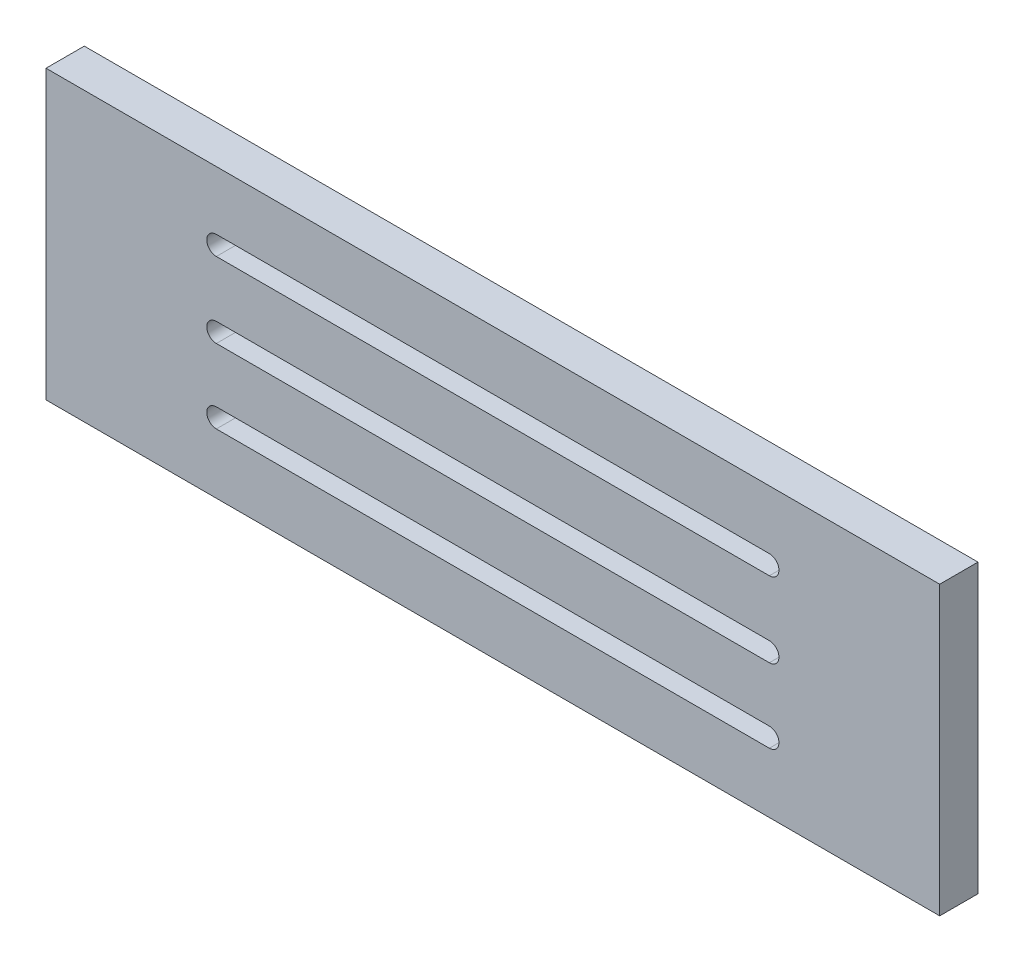
ISO-10303-21;
HEADER;
FILE_DESCRIPTION(('STEP AP214'),'2;1');
FILE_NAME('part.step','',(''),(''),'','','');
FILE_SCHEMA(('AUTOMOTIVE_DESIGN { 1 0 10303 214 1 1 1 1 }'));
ENDSEC;
DATA;
#1=APPLICATION_CONTEXT('core data for automotive mechanical design processes');
#2=APPLICATION_PROTOCOL_DEFINITION('international standard','automotive_design',2000,#1);
#3=PRODUCT_CONTEXT('',#1,'mechanical');
#4=PRODUCT('Part','Part','',(#3));
#5=PRODUCT_RELATED_PRODUCT_CATEGORY('part','',(#4));
#6=PRODUCT_DEFINITION_FORMATION('','',#4);
#7=PRODUCT_DEFINITION_CONTEXT('part definition',#1,'design');
#8=PRODUCT_DEFINITION('design','',#6,#7);
#9=PRODUCT_DEFINITION_SHAPE('','',#8);
#10=(LENGTH_UNIT() NAMED_UNIT(*) SI_UNIT(.MILLI.,.METRE.));
#11=(NAMED_UNIT(*) PLANE_ANGLE_UNIT() SI_UNIT($,.RADIAN.));
#12=(NAMED_UNIT(*) SI_UNIT($,.STERADIAN.) SOLID_ANGLE_UNIT());
#13=UNCERTAINTY_MEASURE_WITH_UNIT(LENGTH_MEASURE(1.E-05),#10,'distance_accuracy_value','');
#14=(GEOMETRIC_REPRESENTATION_CONTEXT(3) GLOBAL_UNCERTAINTY_ASSIGNED_CONTEXT((#13)) GLOBAL_UNIT_ASSIGNED_CONTEXT((#10,
#11,#12)) REPRESENTATION_CONTEXT('',''));
#15=CARTESIAN_POINT('',(0.,0.,0.));
#16=DIRECTION('',(0.,0.,1.));
#17=DIRECTION('',(1.,0.,0.));
#18=AXIS2_PLACEMENT_3D('',#15,#16,#17);
#19=CARTESIAN_POINT('',(0.,0.,6.));
#20=DIRECTION('',(0.,0.,-1.));
#21=DIRECTION('',(-1.,0.,0.));
#22=AXIS2_PLACEMENT_3D('',#19,#20,#21);
#23=PLANE('',#22);
#24=CARTESIAN_POINT('',(26.6832032308396,34.3036981476396,6.));
#25=DIRECTION('',(0.,0.,1.));
#26=DIRECTION('',(1.,0.,0.));
#27=AXIS2_PLACEMENT_3D('',#24,#25,#26);
#28=CIRCLE('',#27,1.5);
#29=CARTESIAN_POINT('',(26.6832032308396,35.8036981476396,6.));
#30=VERTEX_POINT('',#29);
#31=CARTESIAN_POINT('',(26.6832032308396,32.8036981476396,6.));
#32=VERTEX_POINT('',#31);
#33=EDGE_CURVE('E185',#30,#32,#28,.T.);
#34=ORIENTED_EDGE('',*,*,#33,.F.);
#35=DIRECTION('',(-1.,0.,0.));
#36=VECTOR('',#35,1.);
#37=CARTESIAN_POINT('',(26.6832032308396,35.8036981476396,6.));
#38=LINE('',#37,#36);
#39=CARTESIAN_POINT('',(113.31679676916,35.8036981476396,6.));
#40=VERTEX_POINT('',#39);
#41=EDGE_CURVE('E193',#40,#30,#38,.T.);
#42=ORIENTED_EDGE('',*,*,#41,.F.);
#43=CARTESIAN_POINT('',(113.31679676916,34.3036981476396,6.));
#44=DIRECTION('',(0.,0.,1.));
#45=DIRECTION('',(1.,0.,0.));
#46=AXIS2_PLACEMENT_3D('',#43,#44,#45);
#47=CIRCLE('',#46,1.5);
#48=CARTESIAN_POINT('',(113.31679676916,32.8036981476396,6.));
#49=VERTEX_POINT('',#48);
#50=EDGE_CURVE('E190',#49,#40,#47,.T.);
#51=ORIENTED_EDGE('',*,*,#50,.F.);
#52=DIRECTION('',(1.,0.,0.));
#53=VECTOR('',#52,1.);
#54=CARTESIAN_POINT('',(26.6832032308396,32.8036981476396,6.));
#55=LINE('',#54,#53);
#56=EDGE_CURVE('E187',#32,#49,#55,.T.);
#57=ORIENTED_EDGE('',*,*,#56,.F.);
#58=EDGE_LOOP('',(#34,#42,#51,#57));
#59=FACE_BOUND('',#58,.T.);
#60=DIRECTION('',(0.,-1.,0.));
#61=VECTOR('',#60,1.);
#62=CARTESIAN_POINT('',(0.,0.,6.));
#63=LINE('',#62,#61);
#64=CARTESIAN_POINT('',(0.,45.,6.));
#65=VERTEX_POINT('',#64);
#66=CARTESIAN_POINT('',(0.,0.,6.));
#67=VERTEX_POINT('',#66);
#68=EDGE_CURVE('E247',#65,#67,#63,.T.);
#69=ORIENTED_EDGE('',*,*,#68,.T.);
#70=DIRECTION('',(1.,0.,0.));
#71=VECTOR('',#70,1.);
#72=CARTESIAN_POINT('',(0.,0.,6.));
#73=LINE('',#72,#71);
#74=CARTESIAN_POINT('',(140.,0.,6.));
#75=VERTEX_POINT('',#74);
#76=EDGE_CURVE('E250',#67,#75,#73,.T.);
#77=ORIENTED_EDGE('',*,*,#76,.T.);
#78=DIRECTION('',(0.,1.,0.));
#79=VECTOR('',#78,1.);
#80=CARTESIAN_POINT('',(140.,0.,6.));
#81=LINE('',#80,#79);
#82=CARTESIAN_POINT('',(140.,45.,6.));
#83=VERTEX_POINT('',#82);
#84=EDGE_CURVE('E253',#75,#83,#81,.T.);
#85=ORIENTED_EDGE('',*,*,#84,.T.);
#86=DIRECTION('',(-1.,0.,0.));
#87=VECTOR('',#86,1.);
#88=CARTESIAN_POINT('',(0.,45.,6.));
#89=LINE('',#88,#87);
#90=EDGE_CURVE('E255',#83,#65,#89,.T.);
#91=ORIENTED_EDGE('',*,*,#90,.T.);
#92=EDGE_LOOP('',(#69,#77,#85,#91));
#93=FACE_BOUND('',#92,.T.);
#94=CARTESIAN_POINT('',(26.6832032308396,22.5,6.));
#95=DIRECTION('',(0.,0.,1.));
#96=DIRECTION('',(1.,0.,0.));
#97=AXIS2_PLACEMENT_3D('',#94,#95,#96);
#98=CIRCLE('',#97,1.5);
#99=CARTESIAN_POINT('',(26.6832032308396,24.,6.));
#100=VERTEX_POINT('',#99);
#101=CARTESIAN_POINT('',(26.6832032308396,21.,6.));
#102=VERTEX_POINT('',#101);
#103=EDGE_CURVE('E216',#100,#102,#98,.T.);
#104=ORIENTED_EDGE('',*,*,#103,.F.);
#105=DIRECTION('',(-1.,0.,0.));
#106=VECTOR('',#105,1.);
#107=CARTESIAN_POINT('',(26.6832032308396,24.,6.));
#108=LINE('',#107,#106);
#109=CARTESIAN_POINT('',(113.31679676916,24.,6.));
#110=VERTEX_POINT('',#109);
#111=EDGE_CURVE('E224',#110,#100,#108,.T.);
#112=ORIENTED_EDGE('',*,*,#111,.F.);
#113=CARTESIAN_POINT('',(113.31679676916,22.5,6.));
#114=DIRECTION('',(0.,0.,1.));
#115=DIRECTION('',(1.,0.,0.));
#116=AXIS2_PLACEMENT_3D('',#113,#114,#115);
#117=CIRCLE('',#116,1.5);
#118=CARTESIAN_POINT('',(113.31679676916,21.,6.));
#119=VERTEX_POINT('',#118);
#120=EDGE_CURVE('E221',#119,#110,#117,.T.);
#121=ORIENTED_EDGE('',*,*,#120,.F.);
#122=DIRECTION('',(1.,0.,0.));
#123=VECTOR('',#122,1.);
#124=CARTESIAN_POINT('',(26.6832032308396,21.,6.));
#125=LINE('',#124,#123);
#126=EDGE_CURVE('E218',#102,#119,#125,.T.);
#127=ORIENTED_EDGE('',*,*,#126,.F.);
#128=EDGE_LOOP('',(#104,#112,#121,#127));
#129=FACE_BOUND('',#128,.T.);
#130=CARTESIAN_POINT('',(26.6832032308396,10.9053187025472,6.));
#131=DIRECTION('',(0.,0.,1.));
#132=DIRECTION('',(1.,0.,0.));
#133=AXIS2_PLACEMENT_3D('',#130,#131,#132);
#134=CIRCLE('',#133,1.5);
#135=CARTESIAN_POINT('',(26.6832032308396,12.4053187025472,6.));
#136=VERTEX_POINT('',#135);
#137=CARTESIAN_POINT('',(26.6832032308396,9.40531870254718,6.));
#138=VERTEX_POINT('',#137);
#139=EDGE_CURVE('E149',#136,#138,#134,.T.);
#140=ORIENTED_EDGE('',*,*,#139,.F.);
#141=DIRECTION('',(-1.,0.,0.));
#142=VECTOR('',#141,1.);
#143=CARTESIAN_POINT('',(26.6832032308396,12.4053187025472,6.));
#144=LINE('',#143,#142);
#145=CARTESIAN_POINT('',(113.31679676916,12.4053187025472,6.));
#146=VERTEX_POINT('',#145);
#147=EDGE_CURVE('E171',#146,#136,#144,.T.);
#148=ORIENTED_EDGE('',*,*,#147,.F.);
#149=CARTESIAN_POINT('',(113.31679676916,10.9053187025472,6.));
#150=DIRECTION('',(0.,0.,1.));
#151=DIRECTION('',(1.,0.,0.));
#152=AXIS2_PLACEMENT_3D('',#149,#150,#151);
#153=CIRCLE('',#152,1.5);
#154=CARTESIAN_POINT('',(113.31679676916,9.40531870254718,6.));
#155=VERTEX_POINT('',#154);
#156=EDGE_CURVE('E169',#155,#146,#153,.T.);
#157=ORIENTED_EDGE('',*,*,#156,.F.);
#158=DIRECTION('',(1.,0.,0.));
#159=VECTOR('',#158,1.);
#160=CARTESIAN_POINT('',(26.6832032308396,9.40531870254718,6.));
#161=LINE('',#160,#159);
#162=EDGE_CURVE('E157',#138,#155,#161,.T.);
#163=ORIENTED_EDGE('',*,*,#162,.F.);
#164=EDGE_LOOP('',(#140,#148,#157,#163));
#165=FACE_BOUND('',#164,.T.);
#166=ADVANCED_FACE('F36',(#59,#93,#129,#165),#23,.F.);
#167=CARTESIAN_POINT('',(0.,0.,0.));
#168=DIRECTION('',(0.,0.,-1.));
#169=DIRECTION('',(-1.,0.,0.));
#170=AXIS2_PLACEMENT_3D('',#167,#168,#169);
#171=PLANE('',#170);
#172=DIRECTION('',(0.,-1.,0.));
#173=VECTOR('',#172,1.);
#174=CARTESIAN_POINT('',(0.,0.,0.));
#175=LINE('',#174,#173);
#176=CARTESIAN_POINT('',(0.,45.,0.));
#177=VERTEX_POINT('',#176);
#178=CARTESIAN_POINT('',(0.,0.,0.));
#179=VERTEX_POINT('',#178);
#180=EDGE_CURVE('E246',#177,#179,#175,.T.);
#181=ORIENTED_EDGE('',*,*,#180,.F.);
#182=DIRECTION('',(-1.,0.,0.));
#183=VECTOR('',#182,1.);
#184=CARTESIAN_POINT('',(0.,45.,0.));
#185=LINE('',#184,#183);
#186=CARTESIAN_POINT('',(140.,45.,0.));
#187=VERTEX_POINT('',#186);
#188=EDGE_CURVE('E251',#187,#177,#185,.T.);
#189=ORIENTED_EDGE('',*,*,#188,.F.);
#190=DIRECTION('',(0.,1.,0.));
#191=VECTOR('',#190,1.);
#192=CARTESIAN_POINT('',(140.,0.,0.));
#193=LINE('',#192,#191);
#194=CARTESIAN_POINT('',(140.,0.,0.));
#195=VERTEX_POINT('',#194);
#196=EDGE_CURVE('E262',#195,#187,#193,.T.);
#197=ORIENTED_EDGE('',*,*,#196,.F.);
#198=DIRECTION('',(1.,0.,0.));
#199=VECTOR('',#198,1.);
#200=CARTESIAN_POINT('',(0.,0.,0.));
#201=LINE('',#200,#199);
#202=EDGE_CURVE('E260',#179,#195,#201,.T.);
#203=ORIENTED_EDGE('',*,*,#202,.F.);
#204=EDGE_LOOP('',(#181,#189,#197,#203));
#205=FACE_BOUND('',#204,.T.);
#206=DIRECTION('',(-1.,0.,0.));
#207=VECTOR('',#206,1.);
#208=CARTESIAN_POINT('',(26.6832032308396,24.,0.));
#209=LINE('',#208,#207);
#210=CARTESIAN_POINT('',(113.31679676916,24.,0.));
#211=VERTEX_POINT('',#210);
#212=CARTESIAN_POINT('',(26.6832032308396,24.,0.));
#213=VERTEX_POINT('',#212);
#214=EDGE_CURVE('E219',#211,#213,#209,.T.);
#215=ORIENTED_EDGE('',*,*,#214,.T.);
#216=CARTESIAN_POINT('',(26.6832032308396,22.5,0.));
#217=DIRECTION('',(0.,0.,1.));
#218=DIRECTION('',(1.,0.,0.));
#219=AXIS2_PLACEMENT_3D('',#216,#217,#218);
#220=CIRCLE('',#219,1.5);
#221=CARTESIAN_POINT('',(26.6832032308396,21.,0.));
#222=VERTEX_POINT('',#221);
#223=EDGE_CURVE('E215',#213,#222,#220,.T.);
#224=ORIENTED_EDGE('',*,*,#223,.T.);
#225=DIRECTION('',(1.,0.,0.));
#226=VECTOR('',#225,1.);
#227=CARTESIAN_POINT('',(26.6832032308396,21.,0.));
#228=LINE('',#227,#226);
#229=CARTESIAN_POINT('',(113.31679676916,21.,0.));
#230=VERTEX_POINT('',#229);
#231=EDGE_CURVE('E229',#222,#230,#228,.T.);
#232=ORIENTED_EDGE('',*,*,#231,.T.);
#233=CARTESIAN_POINT('',(113.31679676916,22.5,0.));
#234=DIRECTION('',(0.,0.,1.));
#235=DIRECTION('',(1.,0.,0.));
#236=AXIS2_PLACEMENT_3D('',#233,#234,#235);
#237=CIRCLE('',#236,1.5);
#238=EDGE_CURVE('E232',#230,#211,#237,.T.);
#239=ORIENTED_EDGE('',*,*,#238,.T.);
#240=EDGE_LOOP('',(#215,#224,#232,#239));
#241=FACE_BOUND('',#240,.T.);
#242=DIRECTION('',(-1.,0.,0.));
#243=VECTOR('',#242,1.);
#244=CARTESIAN_POINT('',(26.6832032308396,35.8036981476396,0.));
#245=LINE('',#244,#243);
#246=CARTESIAN_POINT('',(113.31679676916,35.8036981476396,0.));
#247=VERTEX_POINT('',#246);
#248=CARTESIAN_POINT('',(26.6832032308396,35.8036981476396,0.));
#249=VERTEX_POINT('',#248);
#250=EDGE_CURVE('E188',#247,#249,#245,.T.);
#251=ORIENTED_EDGE('',*,*,#250,.T.);
#252=CARTESIAN_POINT('',(26.6832032308396,34.3036981476396,0.));
#253=DIRECTION('',(0.,0.,1.));
#254=DIRECTION('',(1.,0.,0.));
#255=AXIS2_PLACEMENT_3D('',#252,#253,#254);
#256=CIRCLE('',#255,1.5);
#257=CARTESIAN_POINT('',(26.6832032308396,32.8036981476396,0.));
#258=VERTEX_POINT('',#257);
#259=EDGE_CURVE('E165',#249,#258,#256,.T.);
#260=ORIENTED_EDGE('',*,*,#259,.T.);
#261=DIRECTION('',(1.,0.,0.));
#262=VECTOR('',#261,1.);
#263=CARTESIAN_POINT('',(26.6832032308396,32.8036981476396,0.));
#264=LINE('',#263,#262);
#265=CARTESIAN_POINT('',(113.31679676916,32.8036981476396,0.));
#266=VERTEX_POINT('',#265);
#267=EDGE_CURVE('E198',#258,#266,#264,.T.);
#268=ORIENTED_EDGE('',*,*,#267,.T.);
#269=CARTESIAN_POINT('',(113.31679676916,34.3036981476396,0.));
#270=DIRECTION('',(0.,0.,1.));
#271=DIRECTION('',(1.,0.,0.));
#272=AXIS2_PLACEMENT_3D('',#269,#270,#271);
#273=CIRCLE('',#272,1.5);
#274=EDGE_CURVE('E201',#266,#247,#273,.T.);
#275=ORIENTED_EDGE('',*,*,#274,.T.);
#276=EDGE_LOOP('',(#251,#260,#268,#275));
#277=FACE_BOUND('',#276,.T.);
#278=DIRECTION('',(-1.,0.,0.));
#279=VECTOR('',#278,1.);
#280=CARTESIAN_POINT('',(26.6832032308396,12.4053187025472,0.));
#281=LINE('',#280,#279);
#282=CARTESIAN_POINT('',(113.31679676916,12.4053187025472,0.));
#283=VERTEX_POINT('',#282);
#284=CARTESIAN_POINT('',(26.6832032308396,12.4053187025472,0.));
#285=VERTEX_POINT('',#284);
#286=EDGE_CURVE('E158',#283,#285,#281,.T.);
#287=ORIENTED_EDGE('',*,*,#286,.T.);
#288=CARTESIAN_POINT('',(26.6832032308396,10.9053187025472,0.));
#289=DIRECTION('',(0.,0.,1.));
#290=DIRECTION('',(1.,0.,0.));
#291=AXIS2_PLACEMENT_3D('',#288,#289,#290);
#292=CIRCLE('',#291,1.5);
#293=CARTESIAN_POINT('',(26.6832032308396,9.40531870254718,0.));
#294=VERTEX_POINT('',#293);
#295=EDGE_CURVE('E59',#285,#294,#292,.T.);
#296=ORIENTED_EDGE('',*,*,#295,.T.);
#297=DIRECTION('',(1.,0.,0.));
#298=VECTOR('',#297,1.);
#299=CARTESIAN_POINT('',(26.6832032308396,9.40531870254718,0.));
#300=LINE('',#299,#298);
#301=CARTESIAN_POINT('',(113.31679676916,9.40531870254718,0.));
#302=VERTEX_POINT('',#301);
#303=EDGE_CURVE('E164',#294,#302,#300,.T.);
#304=ORIENTED_EDGE('',*,*,#303,.T.);
#305=CARTESIAN_POINT('',(113.31679676916,10.9053187025472,0.));
#306=DIRECTION('',(0.,0.,1.));
#307=DIRECTION('',(1.,0.,0.));
#308=AXIS2_PLACEMENT_3D('',#305,#306,#307);
#309=CIRCLE('',#308,1.5);
#310=EDGE_CURVE('E177',#302,#283,#309,.T.);
#311=ORIENTED_EDGE('',*,*,#310,.T.);
#312=EDGE_LOOP('',(#287,#296,#304,#311));
#313=FACE_BOUND('',#312,.T.);
#314=ADVANCED_FACE('F280',(#205,#241,#277,#313),#171,.T.);
#315=CARTESIAN_POINT('',(0.,0.,6.));
#316=DIRECTION('',(1.,0.,0.));
#317=DIRECTION('',(0.,0.,-1.));
#318=AXIS2_PLACEMENT_3D('',#315,#316,#317);
#319=PLANE('',#318);
#320=ORIENTED_EDGE('',*,*,#180,.T.);
#321=DIRECTION('',(0.,0.,-1.));
#322=VECTOR('',#321,1.);
#323=CARTESIAN_POINT('',(0.,0.,6.));
#324=LINE('',#323,#322);
#325=EDGE_CURVE('E11',#67,#179,#324,.T.);
#326=ORIENTED_EDGE('',*,*,#325,.F.);
#327=ORIENTED_EDGE('',*,*,#68,.F.);
#328=DIRECTION('',(0.,0.,-1.));
#329=VECTOR('',#328,1.);
#330=CARTESIAN_POINT('',(0.,45.,6.));
#331=LINE('',#330,#329);
#332=EDGE_CURVE('E257',#65,#177,#331,.T.);
#333=ORIENTED_EDGE('',*,*,#332,.T.);
#334=EDGE_LOOP('',(#320,#326,#327,#333));
#335=FACE_BOUND('',#334,.T.);
#336=ADVANCED_FACE('F38',(#335),#319,.F.);
#337=CARTESIAN_POINT('',(0.,0.,6.));
#338=DIRECTION('',(0.,1.,0.));
#339=DIRECTION('',(0.,0.,1.));
#340=AXIS2_PLACEMENT_3D('',#337,#338,#339);
#341=PLANE('',#340);
#342=ORIENTED_EDGE('',*,*,#202,.T.);
#343=DIRECTION('',(0.,0.,-1.));
#344=VECTOR('',#343,1.);
#345=CARTESIAN_POINT('',(140.,0.,6.));
#346=LINE('',#345,#344);
#347=EDGE_CURVE('E44',#75,#195,#346,.T.);
#348=ORIENTED_EDGE('',*,*,#347,.F.);
#349=ORIENTED_EDGE('',*,*,#76,.F.);
#350=ORIENTED_EDGE('',*,*,#325,.T.);
#351=EDGE_LOOP('',(#342,#348,#349,#350));
#352=FACE_BOUND('',#351,.T.);
#353=ADVANCED_FACE('F291',(#352),#341,.F.);
#354=CARTESIAN_POINT('',(140.,0.,6.));
#355=DIRECTION('',(-1.,0.,0.));
#356=DIRECTION('',(0.,0.,1.));
#357=AXIS2_PLACEMENT_3D('',#354,#355,#356);
#358=PLANE('',#357);
#359=ORIENTED_EDGE('',*,*,#196,.T.);
#360=DIRECTION('',(0.,0.,-1.));
#361=VECTOR('',#360,1.);
#362=CARTESIAN_POINT('',(140.,45.,6.));
#363=LINE('',#362,#361);
#364=EDGE_CURVE('E267',#83,#187,#363,.T.);
#365=ORIENTED_EDGE('',*,*,#364,.F.);
#366=ORIENTED_EDGE('',*,*,#84,.F.);
#367=ORIENTED_EDGE('',*,*,#347,.T.);
#368=EDGE_LOOP('',(#359,#365,#366,#367));
#369=FACE_BOUND('',#368,.T.);
#370=ADVANCED_FACE('F274',(#369),#358,.F.);
#371=CARTESIAN_POINT('',(0.,45.,6.));
#372=DIRECTION('',(0.,-1.,0.));
#373=DIRECTION('',(0.,0.,-1.));
#374=AXIS2_PLACEMENT_3D('',#371,#372,#373);
#375=PLANE('',#374);
#376=ORIENTED_EDGE('',*,*,#188,.T.);
#377=ORIENTED_EDGE('',*,*,#332,.F.);
#378=ORIENTED_EDGE('',*,*,#90,.F.);
#379=ORIENTED_EDGE('',*,*,#364,.T.);
#380=EDGE_LOOP('',(#376,#377,#378,#379));
#381=FACE_BOUND('',#380,.T.);
#382=ADVANCED_FACE('F284',(#381),#375,.F.);
#383=CARTESIAN_POINT('',(26.6832032308396,22.5,6.));
#384=DIRECTION('',(0.,0.,-1.));
#385=DIRECTION('',(-1.,0.,0.));
#386=AXIS2_PLACEMENT_3D('',#383,#384,#385);
#387=CYLINDRICAL_SURFACE('',#386,1.5);
#388=ORIENTED_EDGE('',*,*,#223,.F.);
#389=DIRECTION('',(0.,0.,-1.));
#390=VECTOR('',#389,1.);
#391=CARTESIAN_POINT('',(26.6832032308396,24.,6.));
#392=LINE('',#391,#390);
#393=EDGE_CURVE('E226',#100,#213,#392,.T.);
#394=ORIENTED_EDGE('',*,*,#393,.F.);
#395=ORIENTED_EDGE('',*,*,#103,.T.);
#396=DIRECTION('',(0.,0.,-1.));
#397=VECTOR('',#396,1.);
#398=CARTESIAN_POINT('',(26.6832032308396,21.,6.));
#399=LINE('',#398,#397);
#400=EDGE_CURVE('E243',#102,#222,#399,.T.);
#401=ORIENTED_EDGE('',*,*,#400,.T.);
#402=EDGE_LOOP('',(#388,#394,#395,#401));
#403=FACE_BOUND('',#402,.T.);
#404=ADVANCED_FACE('F307',(#403),#387,.F.);
#405=CARTESIAN_POINT('',(26.6832032308396,21.,6.));
#406=DIRECTION('',(0.,1.,0.));
#407=DIRECTION('',(-1.,0.,0.));
#408=AXIS2_PLACEMENT_3D('',#405,#406,#407);
#409=PLANE('',#408);
#410=ORIENTED_EDGE('',*,*,#231,.F.);
#411=ORIENTED_EDGE('',*,*,#400,.F.);
#412=ORIENTED_EDGE('',*,*,#126,.T.);
#413=DIRECTION('',(0.,0.,-1.));
#414=VECTOR('',#413,1.);
#415=CARTESIAN_POINT('',(113.31679676916,21.,6.));
#416=LINE('',#415,#414);
#417=EDGE_CURVE('E241',#119,#230,#416,.T.);
#418=ORIENTED_EDGE('',*,*,#417,.T.);
#419=EDGE_LOOP('',(#410,#411,#412,#418));
#420=FACE_BOUND('',#419,.T.);
#421=ADVANCED_FACE('F314',(#420),#409,.T.);
#422=CARTESIAN_POINT('',(113.31679676916,22.5,6.));
#423=DIRECTION('',(0.,0.,-1.));
#424=DIRECTION('',(-1.,0.,0.));
#425=AXIS2_PLACEMENT_3D('',#422,#423,#424);
#426=CYLINDRICAL_SURFACE('',#425,1.5);
#427=ORIENTED_EDGE('',*,*,#238,.F.);
#428=ORIENTED_EDGE('',*,*,#417,.F.);
#429=ORIENTED_EDGE('',*,*,#120,.T.);
#430=DIRECTION('',(0.,0.,-1.));
#431=VECTOR('',#430,1.);
#432=CARTESIAN_POINT('',(113.31679676916,24.,6.));
#433=LINE('',#432,#431);
#434=EDGE_CURVE('E239',#110,#211,#433,.T.);
#435=ORIENTED_EDGE('',*,*,#434,.T.);
#436=EDGE_LOOP('',(#427,#428,#429,#435));
#437=FACE_BOUND('',#436,.T.);
#438=ADVANCED_FACE('F319',(#437),#426,.F.);
#439=CARTESIAN_POINT('',(26.6832032308396,24.,6.));
#440=DIRECTION('',(0.,-1.,0.));
#441=DIRECTION('',(1.,0.,0.));
#442=AXIS2_PLACEMENT_3D('',#439,#440,#441);
#443=PLANE('',#442);
#444=ORIENTED_EDGE('',*,*,#214,.F.);
#445=ORIENTED_EDGE('',*,*,#434,.F.);
#446=ORIENTED_EDGE('',*,*,#111,.T.);
#447=ORIENTED_EDGE('',*,*,#393,.T.);
#448=EDGE_LOOP('',(#444,#445,#446,#447));
#449=FACE_BOUND('',#448,.T.);
#450=ADVANCED_FACE('F326',(#449),#443,.T.);
#451=CARTESIAN_POINT('',(26.6832032308396,34.3036981476396,6.));
#452=DIRECTION('',(0.,0.,-1.));
#453=DIRECTION('',(-1.,0.,0.));
#454=AXIS2_PLACEMENT_3D('',#451,#452,#453);
#455=CYLINDRICAL_SURFACE('',#454,1.5);
#456=ORIENTED_EDGE('',*,*,#259,.F.);
#457=DIRECTION('',(0.,0.,-1.));
#458=VECTOR('',#457,1.);
#459=CARTESIAN_POINT('',(26.6832032308396,35.8036981476396,6.));
#460=LINE('',#459,#458);
#461=EDGE_CURVE('E195',#30,#249,#460,.T.);
#462=ORIENTED_EDGE('',*,*,#461,.F.);
#463=ORIENTED_EDGE('',*,*,#33,.T.);
#464=DIRECTION('',(0.,0.,-1.));
#465=VECTOR('',#464,1.);
#466=CARTESIAN_POINT('',(26.6832032308396,32.8036981476396,6.));
#467=LINE('',#466,#465);
#468=EDGE_CURVE('E212',#32,#258,#467,.T.);
#469=ORIENTED_EDGE('',*,*,#468,.T.);
#470=EDGE_LOOP('',(#456,#462,#463,#469));
#471=FACE_BOUND('',#470,.T.);
#472=ADVANCED_FACE('F339',(#471),#455,.F.);
#473=CARTESIAN_POINT('',(26.6832032308396,32.8036981476396,6.));
#474=DIRECTION('',(0.,1.,0.));
#475=DIRECTION('',(-1.,0.,0.));
#476=AXIS2_PLACEMENT_3D('',#473,#474,#475);
#477=PLANE('',#476);
#478=ORIENTED_EDGE('',*,*,#267,.F.);
#479=ORIENTED_EDGE('',*,*,#468,.F.);
#480=ORIENTED_EDGE('',*,*,#56,.T.);
#481=DIRECTION('',(0.,0.,-1.));
#482=VECTOR('',#481,1.);
#483=CARTESIAN_POINT('',(113.31679676916,32.8036981476396,6.));
#484=LINE('',#483,#482);
#485=EDGE_CURVE('E210',#49,#266,#484,.T.);
#486=ORIENTED_EDGE('',*,*,#485,.T.);
#487=EDGE_LOOP('',(#478,#479,#480,#486));
#488=FACE_BOUND('',#487,.T.);
#489=ADVANCED_FACE('F344',(#488),#477,.T.);
#490=CARTESIAN_POINT('',(113.31679676916,34.3036981476396,6.));
#491=DIRECTION('',(0.,0.,-1.));
#492=DIRECTION('',(-1.,0.,0.));
#493=AXIS2_PLACEMENT_3D('',#490,#491,#492);
#494=CYLINDRICAL_SURFACE('',#493,1.5);
#495=ORIENTED_EDGE('',*,*,#274,.F.);
#496=ORIENTED_EDGE('',*,*,#485,.F.);
#497=ORIENTED_EDGE('',*,*,#50,.T.);
#498=DIRECTION('',(0.,0.,-1.));
#499=VECTOR('',#498,1.);
#500=CARTESIAN_POINT('',(113.31679676916,35.8036981476396,6.));
#501=LINE('',#500,#499);
#502=EDGE_CURVE('E208',#40,#247,#501,.T.);
#503=ORIENTED_EDGE('',*,*,#502,.T.);
#504=EDGE_LOOP('',(#495,#496,#497,#503));
#505=FACE_BOUND('',#504,.T.);
#506=ADVANCED_FACE('F348',(#505),#494,.F.);
#507=CARTESIAN_POINT('',(26.6832032308396,35.8036981476396,6.));
#508=DIRECTION('',(0.,-1.,0.));
#509=DIRECTION('',(1.,0.,0.));
#510=AXIS2_PLACEMENT_3D('',#507,#508,#509);
#511=PLANE('',#510);
#512=ORIENTED_EDGE('',*,*,#250,.F.);
#513=ORIENTED_EDGE('',*,*,#502,.F.);
#514=ORIENTED_EDGE('',*,*,#41,.T.);
#515=ORIENTED_EDGE('',*,*,#461,.T.);
#516=EDGE_LOOP('',(#512,#513,#514,#515));
#517=FACE_BOUND('',#516,.T.);
#518=ADVANCED_FACE('F352',(#517),#511,.T.);
#519=CARTESIAN_POINT('',(26.6832032308396,10.9053187025472,6.));
#520=DIRECTION('',(0.,0.,-1.));
#521=DIRECTION('',(-1.,0.,0.));
#522=AXIS2_PLACEMENT_3D('',#519,#520,#521);
#523=CYLINDRICAL_SURFACE('',#522,1.5);
#524=ORIENTED_EDGE('',*,*,#295,.F.);
#525=DIRECTION('',(0.,0.,-1.));
#526=VECTOR('',#525,1.);
#527=CARTESIAN_POINT('',(26.6832032308396,12.4053187025472,6.));
#528=LINE('',#527,#526);
#529=EDGE_CURVE('E153',#136,#285,#528,.T.);
#530=ORIENTED_EDGE('',*,*,#529,.F.);
#531=ORIENTED_EDGE('',*,*,#139,.T.);
#532=DIRECTION('',(0.,0.,-1.));
#533=VECTOR('',#532,1.);
#534=CARTESIAN_POINT('',(26.6832032308396,9.40531870254718,6.));
#535=LINE('',#534,#533);
#536=EDGE_CURVE('E152',#138,#294,#535,.T.);
#537=ORIENTED_EDGE('',*,*,#536,.T.);
#538=EDGE_LOOP('',(#524,#530,#531,#537));
#539=FACE_BOUND('',#538,.T.);
#540=ADVANCED_FACE('F151',(#539),#523,.F.);
#541=CARTESIAN_POINT('',(26.6832032308396,9.40531870254718,6.));
#542=DIRECTION('',(0.,1.,0.));
#543=DIRECTION('',(-1.,0.,0.));
#544=AXIS2_PLACEMENT_3D('',#541,#542,#543);
#545=PLANE('',#544);
#546=ORIENTED_EDGE('',*,*,#303,.F.);
#547=ORIENTED_EDGE('',*,*,#536,.F.);
#548=ORIENTED_EDGE('',*,*,#162,.T.);
#549=DIRECTION('',(0.,0.,-1.));
#550=VECTOR('',#549,1.);
#551=CARTESIAN_POINT('',(113.31679676916,9.40531870254718,6.));
#552=LINE('',#551,#550);
#553=EDGE_CURVE('E166',#155,#302,#552,.T.);
#554=ORIENTED_EDGE('',*,*,#553,.T.);
#555=EDGE_LOOP('',(#546,#547,#548,#554));
#556=FACE_BOUND('',#555,.T.);
#557=ADVANCED_FACE('F161',(#556),#545,.T.);
#558=CARTESIAN_POINT('',(113.31679676916,10.9053187025472,6.));
#559=DIRECTION('',(0.,0.,-1.));
#560=DIRECTION('',(-1.,0.,0.));
#561=AXIS2_PLACEMENT_3D('',#558,#559,#560);
#562=CYLINDRICAL_SURFACE('',#561,1.5);
#563=ORIENTED_EDGE('',*,*,#310,.F.);
#564=ORIENTED_EDGE('',*,*,#553,.F.);
#565=ORIENTED_EDGE('',*,*,#156,.T.);
#566=DIRECTION('',(0.,0.,-1.));
#567=VECTOR('',#566,1.);
#568=CARTESIAN_POINT('',(113.31679676916,12.4053187025472,6.));
#569=LINE('',#568,#567);
#570=EDGE_CURVE('E51',#146,#283,#569,.T.);
#571=ORIENTED_EDGE('',*,*,#570,.T.);
#572=EDGE_LOOP('',(#563,#564,#565,#571));
#573=FACE_BOUND('',#572,.T.);
#574=ADVANCED_FACE('F361',(#573),#562,.F.);
#575=CARTESIAN_POINT('',(26.6832032308396,12.4053187025472,6.));
#576=DIRECTION('',(0.,-1.,0.));
#577=DIRECTION('',(1.,0.,0.));
#578=AXIS2_PLACEMENT_3D('',#575,#576,#577);
#579=PLANE('',#578);
#580=ORIENTED_EDGE('',*,*,#286,.F.);
#581=ORIENTED_EDGE('',*,*,#570,.F.);
#582=ORIENTED_EDGE('',*,*,#147,.T.);
#583=ORIENTED_EDGE('',*,*,#529,.T.);
#584=EDGE_LOOP('',(#580,#581,#582,#583));
#585=FACE_BOUND('',#584,.T.);
#586=ADVANCED_FACE('F364',(#585),#579,.T.);
#587=CLOSED_SHELL('',(#166,#314,#336,#353,#370,#382,#404,#421,#438,#450,#472,#489,#506,#518,
#540,#557,#574,#586));
#588=MANIFOLD_SOLID_BREP('B2',#587);
#589=ADVANCED_BREP_SHAPE_REPRESENTATION('',(#18,#588),#14);
#590=SHAPE_DEFINITION_REPRESENTATION(#9,#589);
ENDSEC;
END-ISO-10303-21;
